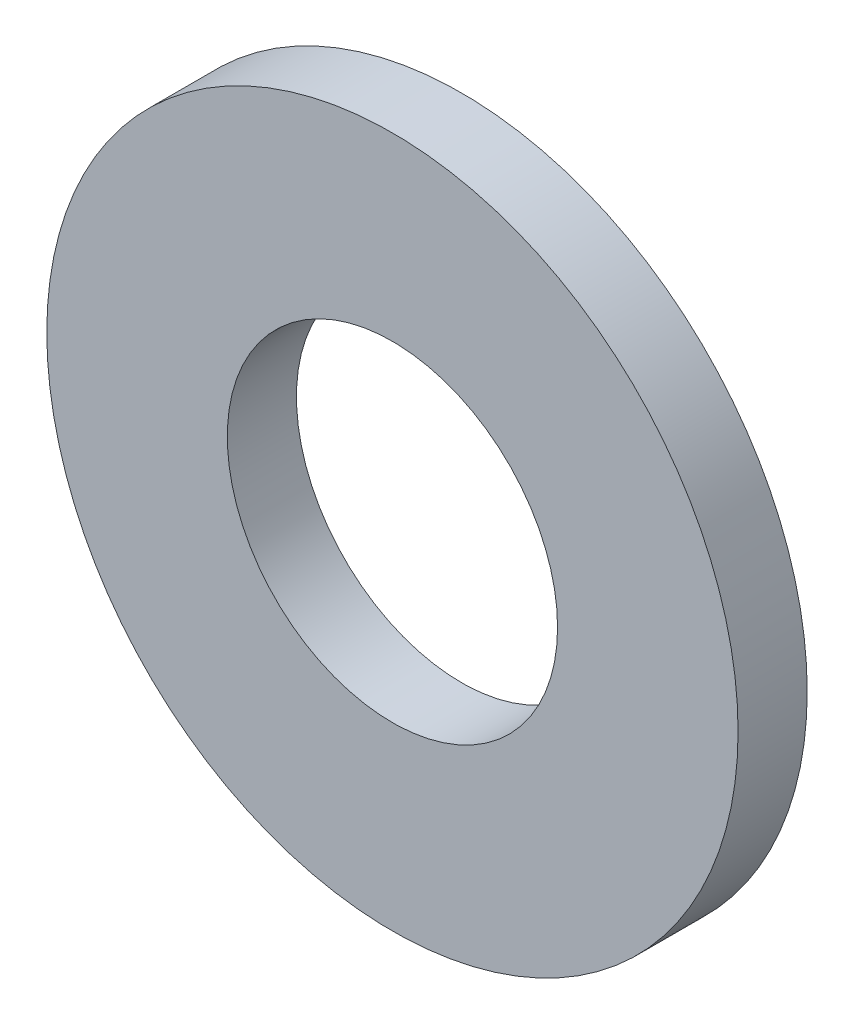
ISO-10303-21;
HEADER;
FILE_DESCRIPTION(('STEP AP214'),'2;1');
FILE_NAME('part.step','',(''),(''),'','','');
FILE_SCHEMA(('AUTOMOTIVE_DESIGN { 1 0 10303 214 1 1 1 1 }'));
ENDSEC;
DATA;
#1=APPLICATION_CONTEXT('core data for automotive mechanical design processes');
#2=APPLICATION_PROTOCOL_DEFINITION('international standard','automotive_design',2000,#1);
#3=PRODUCT_CONTEXT('',#1,'mechanical');
#4=PRODUCT('Part','Part','',(#3));
#5=PRODUCT_RELATED_PRODUCT_CATEGORY('part','',(#4));
#6=PRODUCT_DEFINITION_FORMATION('','',#4);
#7=PRODUCT_DEFINITION_CONTEXT('part definition',#1,'design');
#8=PRODUCT_DEFINITION('design','',#6,#7);
#9=PRODUCT_DEFINITION_SHAPE('','',#8);
#10=(LENGTH_UNIT() NAMED_UNIT(*) SI_UNIT(.MILLI.,.METRE.));
#11=(NAMED_UNIT(*) PLANE_ANGLE_UNIT() SI_UNIT($,.RADIAN.));
#12=(NAMED_UNIT(*) SI_UNIT($,.STERADIAN.) SOLID_ANGLE_UNIT());
#13=UNCERTAINTY_MEASURE_WITH_UNIT(LENGTH_MEASURE(1.E-05),#10,'distance_accuracy_value','');
#14=(GEOMETRIC_REPRESENTATION_CONTEXT(3) GLOBAL_UNCERTAINTY_ASSIGNED_CONTEXT((#13)) GLOBAL_UNIT_ASSIGNED_CONTEXT((#10,
#11,#12)) REPRESENTATION_CONTEXT('',''));
#15=CARTESIAN_POINT('',(0.,0.,0.));
#16=DIRECTION('',(0.,0.,1.));
#17=DIRECTION('',(1.,0.,0.));
#18=AXIS2_PLACEMENT_3D('',#15,#16,#17);
#19=CARTESIAN_POINT('',(0.,0.,0.9));
#20=DIRECTION('',(0.,0.,-1.));
#21=DIRECTION('',(-1.,0.,0.));
#22=AXIS2_PLACEMENT_3D('',#19,#20,#21);
#23=CYLINDRICAL_SURFACE('',#22,2.15);
#24=CARTESIAN_POINT('',(0.,0.,0.9));
#25=DIRECTION('',(0.,0.,1.));
#26=DIRECTION('',(1.,0.,0.));
#27=AXIS2_PLACEMENT_3D('',#24,#25,#26);
#28=CIRCLE('',#27,2.15);
#29=CARTESIAN_POINT('',(2.15,0.,0.9));
#30=VERTEX_POINT('',#29);
#31=EDGE_CURVE('E54',#30,#30,#28,.T.);
#32=ORIENTED_EDGE('',*,*,#31,.T.);
#33=EDGE_LOOP('',(#32));
#34=FACE_BOUND('',#33,.T.);
#35=CARTESIAN_POINT('',(0.,0.,0.));
#36=DIRECTION('',(0.,0.,1.));
#37=DIRECTION('',(1.,0.,0.));
#38=AXIS2_PLACEMENT_3D('',#35,#36,#37);
#39=CIRCLE('',#38,2.15);
#40=CARTESIAN_POINT('',(2.15,0.,0.));
#41=VERTEX_POINT('',#40);
#42=EDGE_CURVE('E11',#41,#41,#39,.T.);
#43=ORIENTED_EDGE('',*,*,#42,.F.);
#44=EDGE_LOOP('',(#43));
#45=FACE_BOUND('',#44,.T.);
#46=ADVANCED_FACE('F16',(#34,#45),#23,.F.);
#47=CARTESIAN_POINT('',(0.,0.,0.9));
#48=DIRECTION('',(0.,0.,-1.));
#49=DIRECTION('',(-1.,0.,0.));
#50=AXIS2_PLACEMENT_3D('',#47,#48,#49);
#51=CYLINDRICAL_SURFACE('',#50,4.5);
#52=CARTESIAN_POINT('',(0.,0.,0.9));
#53=DIRECTION('',(0.,0.,1.));
#54=DIRECTION('',(1.,0.,0.));
#55=AXIS2_PLACEMENT_3D('',#52,#53,#54);
#56=CIRCLE('',#55,4.5);
#57=CARTESIAN_POINT('',(4.5,0.,0.9));
#58=VERTEX_POINT('',#57);
#59=EDGE_CURVE('E20',#58,#58,#56,.T.);
#60=ORIENTED_EDGE('',*,*,#59,.F.);
#61=EDGE_LOOP('',(#60));
#62=FACE_BOUND('',#61,.T.);
#63=CARTESIAN_POINT('',(0.,0.,0.));
#64=DIRECTION('',(0.,0.,1.));
#65=DIRECTION('',(1.,0.,0.));
#66=AXIS2_PLACEMENT_3D('',#63,#64,#65);
#67=CIRCLE('',#66,4.5);
#68=CARTESIAN_POINT('',(4.5,0.,0.));
#69=VERTEX_POINT('',#68);
#70=EDGE_CURVE('E27',#69,#69,#67,.T.);
#71=ORIENTED_EDGE('',*,*,#70,.T.);
#72=EDGE_LOOP('',(#71));
#73=FACE_BOUND('',#72,.T.);
#74=ADVANCED_FACE('F80',(#62,#73),#51,.T.);
#75=CARTESIAN_POINT('',(0.,0.,0.));
#76=DIRECTION('',(0.,0.,1.));
#77=DIRECTION('',(1.,0.,0.));
#78=AXIS2_PLACEMENT_3D('',#75,#76,#77);
#79=PLANE('',#78);
#80=ORIENTED_EDGE('',*,*,#42,.T.);
#81=EDGE_LOOP('',(#80));
#82=FACE_BOUND('',#81,.T.);
#83=ORIENTED_EDGE('',*,*,#70,.F.);
#84=EDGE_LOOP('',(#83));
#85=FACE_BOUND('',#84,.T.);
#86=ADVANCED_FACE('F85',(#82,#85),#79,.F.);
#87=CARTESIAN_POINT('',(0.,0.,0.9));
#88=DIRECTION('',(0.,0.,1.));
#89=DIRECTION('',(1.,0.,0.));
#90=AXIS2_PLACEMENT_3D('',#87,#88,#89);
#91=PLANE('',#90);
#92=ORIENTED_EDGE('',*,*,#31,.F.);
#93=EDGE_LOOP('',(#92));
#94=FACE_BOUND('',#93,.T.);
#95=ORIENTED_EDGE('',*,*,#59,.T.);
#96=EDGE_LOOP('',(#95));
#97=FACE_BOUND('',#96,.T.);
#98=ADVANCED_FACE('F18',(#94,#97),#91,.T.);
#99=CLOSED_SHELL('',(#46,#74,#86,#98));
#100=MANIFOLD_SOLID_BREP('B1',#99);
#101=ADVANCED_BREP_SHAPE_REPRESENTATION('',(#18,#100),#14);
#102=SHAPE_DEFINITION_REPRESENTATION(#9,#101);
ENDSEC;
END-ISO-10303-21;
